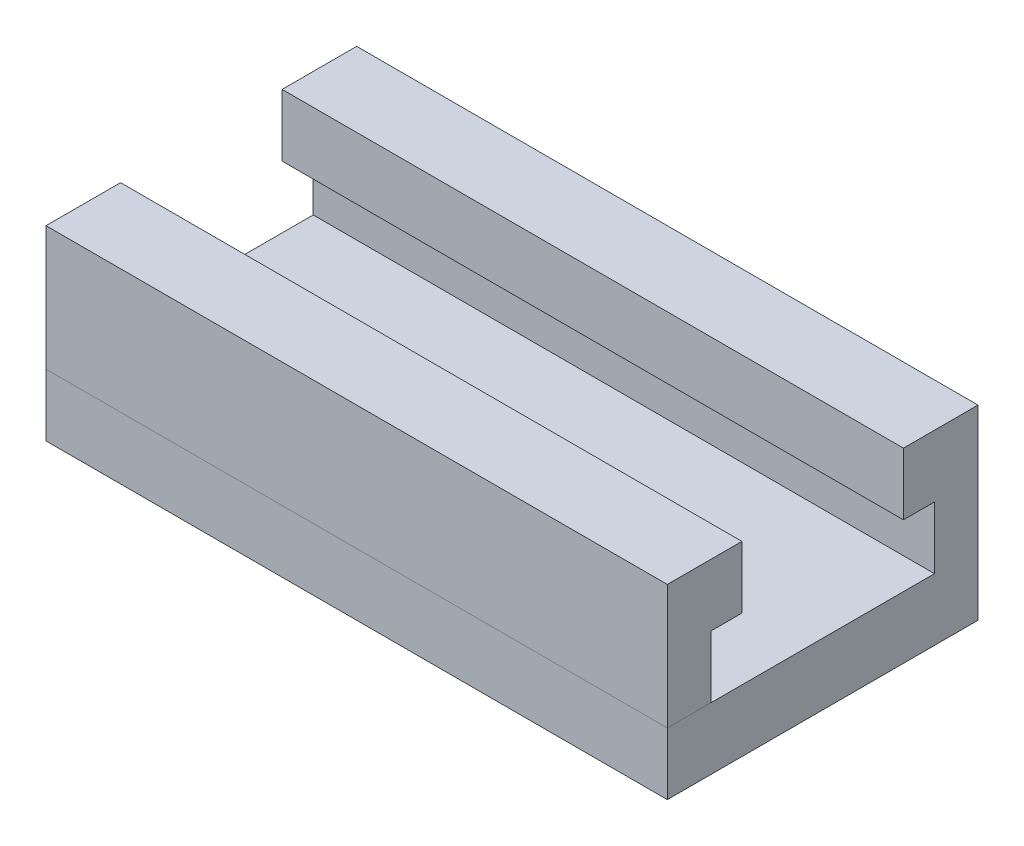
ISO-10303-21;
HEADER;
FILE_DESCRIPTION(('STEP AP214'),'2;1');
FILE_NAME('part.step','',(''),(''),'','','');
FILE_SCHEMA(('AUTOMOTIVE_DESIGN { 1 0 10303 214 1 1 1 1 }'));
ENDSEC;
DATA;
#1=APPLICATION_CONTEXT('core data for automotive mechanical design processes');
#2=APPLICATION_PROTOCOL_DEFINITION('international standard','automotive_design',2000,#1);
#3=PRODUCT_CONTEXT('',#1,'mechanical');
#4=PRODUCT('Part','Part','',(#3));
#5=PRODUCT_RELATED_PRODUCT_CATEGORY('part','',(#4));
#6=PRODUCT_DEFINITION_FORMATION('','',#4);
#7=PRODUCT_DEFINITION_CONTEXT('part definition',#1,'design');
#8=PRODUCT_DEFINITION('design','',#6,#7);
#9=PRODUCT_DEFINITION_SHAPE('','',#8);
#10=(LENGTH_UNIT() NAMED_UNIT(*) SI_UNIT(.MILLI.,.METRE.));
#11=(NAMED_UNIT(*) PLANE_ANGLE_UNIT() SI_UNIT($,.RADIAN.));
#12=(NAMED_UNIT(*) SI_UNIT($,.STERADIAN.) SOLID_ANGLE_UNIT());
#13=UNCERTAINTY_MEASURE_WITH_UNIT(LENGTH_MEASURE(1.E-05),#10,'distance_accuracy_value','');
#14=(GEOMETRIC_REPRESENTATION_CONTEXT(3) GLOBAL_UNCERTAINTY_ASSIGNED_CONTEXT((#13)) GLOBAL_UNIT_ASSIGNED_CONTEXT((#10,
#11,#12)) REPRESENTATION_CONTEXT('',''));
#15=CARTESIAN_POINT('',(0.,0.,0.));
#16=DIRECTION('',(0.,0.,1.));
#17=DIRECTION('',(1.,0.,0.));
#18=AXIS2_PLACEMENT_3D('',#15,#16,#17);
#19=CARTESIAN_POINT('',(0.,2.54,-4.572));
#20=DIRECTION('',(0.,0.,-1.));
#21=DIRECTION('',(-1.,0.,0.));
#22=AXIS2_PLACEMENT_3D('',#19,#20,#21);
#23=PLANE('',#22);
#24=DIRECTION('',(1.,0.,0.));
#25=VECTOR('',#24,1.);
#26=CARTESIAN_POINT('',(0.,0.,-4.572));
#27=LINE('',#26,#25);
#28=CARTESIAN_POINT('',(-9.525,0.,-4.572));
#29=VERTEX_POINT('',#28);
#30=CARTESIAN_POINT('',(15.875,0.,-4.572));
#31=VERTEX_POINT('',#30);
#32=EDGE_CURVE('E47',#29,#31,#27,.T.);
#33=ORIENTED_EDGE('',*,*,#32,.T.);
#34=DIRECTION('',(0.,-1.,0.));
#35=VECTOR('',#34,1.);
#36=CARTESIAN_POINT('',(15.875,2.54,-4.572));
#37=LINE('',#36,#35);
#38=CARTESIAN_POINT('',(15.875,2.54,-4.572));
#39=VERTEX_POINT('',#38);
#40=EDGE_CURVE('E12',#39,#31,#37,.T.);
#41=ORIENTED_EDGE('',*,*,#40,.F.);
#42=DIRECTION('',(1.,0.,0.));
#43=VECTOR('',#42,1.);
#44=CARTESIAN_POINT('',(0.,2.54,-4.572));
#45=LINE('',#44,#43);
#46=CARTESIAN_POINT('',(-9.525,2.54,-4.572));
#47=VERTEX_POINT('',#46);
#48=EDGE_CURVE('E154',#47,#39,#45,.T.);
#49=ORIENTED_EDGE('',*,*,#48,.F.);
#50=DIRECTION('',(0.,-1.,0.));
#51=VECTOR('',#50,1.);
#52=CARTESIAN_POINT('',(-9.525,2.54,-4.572));
#53=LINE('',#52,#51);
#54=EDGE_CURVE('E61',#47,#29,#53,.T.);
#55=ORIENTED_EDGE('',*,*,#54,.T.);
#56=EDGE_LOOP('',(#33,#41,#49,#55));
#57=FACE_BOUND('',#56,.T.);
#58=ADVANCED_FACE('F44',(#57),#23,.F.);
#59=CARTESIAN_POINT('',(15.875,2.54,0.));
#60=DIRECTION('',(1.,0.,0.));
#61=DIRECTION('',(0.,0.,-1.));
#62=AXIS2_PLACEMENT_3D('',#59,#60,#61);
#63=PLANE('',#62);
#64=ORIENTED_EDGE('',*,*,#40,.T.);
#65=DIRECTION('',(0.,0.,1.));
#66=VECTOR('',#65,1.);
#67=CARTESIAN_POINT('',(15.875,0.,-6.35));
#68=LINE('',#67,#66);
#69=CARTESIAN_POINT('',(15.875,0.,6.35));
#70=VERTEX_POINT('',#69);
#71=EDGE_CURVE('E130',#31,#70,#68,.T.);
#72=ORIENTED_EDGE('',*,*,#71,.T.);
#73=DIRECTION('',(0.,1.,0.));
#74=VECTOR('',#73,1.);
#75=CARTESIAN_POINT('',(15.875,-2.54,6.35));
#76=LINE('',#75,#74);
#77=CARTESIAN_POINT('',(15.875,-2.54,6.35));
#78=VERTEX_POINT('',#77);
#79=EDGE_CURVE('E112',#78,#70,#76,.T.);
#80=ORIENTED_EDGE('',*,*,#79,.F.);
#81=DIRECTION('',(0.,0.,1.));
#82=VECTOR('',#81,1.);
#83=CARTESIAN_POINT('',(15.875,-2.54,-6.35));
#84=LINE('',#83,#82);
#85=CARTESIAN_POINT('',(15.875,-2.54,-6.35));
#86=VERTEX_POINT('',#85);
#87=EDGE_CURVE('E119',#86,#78,#84,.T.);
#88=ORIENTED_EDGE('',*,*,#87,.F.);
#89=DIRECTION('',(0.,-1.,0.));
#90=VECTOR('',#89,1.);
#91=CARTESIAN_POINT('',(15.875,2.54,-6.35));
#92=LINE('',#91,#90);
#93=CARTESIAN_POINT('',(15.875,5.08,-6.35));
#94=VERTEX_POINT('',#93);
#95=EDGE_CURVE('E54',#94,#86,#92,.T.);
#96=ORIENTED_EDGE('',*,*,#95,.F.);
#97=DIRECTION('',(0.,0.,1.));
#98=VECTOR('',#97,1.);
#99=CARTESIAN_POINT('',(15.875,5.08,0.));
#100=LINE('',#99,#98);
#101=CARTESIAN_POINT('',(15.875,5.08,-3.302));
#102=VERTEX_POINT('',#101);
#103=EDGE_CURVE('E177',#94,#102,#100,.T.);
#104=ORIENTED_EDGE('',*,*,#103,.T.);
#105=DIRECTION('',(0.,-1.,0.));
#106=VECTOR('',#105,1.);
#107=CARTESIAN_POINT('',(15.875,5.08,-3.302));
#108=LINE('',#107,#106);
#109=CARTESIAN_POINT('',(15.875,2.54,-3.302));
#110=VERTEX_POINT('',#109);
#111=EDGE_CURVE('E191',#102,#110,#108,.T.);
#112=ORIENTED_EDGE('',*,*,#111,.T.);
#113=DIRECTION('',(0.,0.,1.));
#114=VECTOR('',#113,1.);
#115=CARTESIAN_POINT('',(15.875,2.54,0.));
#116=LINE('',#115,#114);
#117=EDGE_CURVE('E132',#39,#110,#116,.T.);
#118=ORIENTED_EDGE('',*,*,#117,.F.);
#119=EDGE_LOOP('',(#64,#72,#80,#88,#96,#104,#112,#118));
#120=FACE_BOUND('',#119,.T.);
#121=ADVANCED_FACE('F129',(#120),#63,.T.);
#122=CARTESIAN_POINT('',(0.,2.54,-6.35));
#123=DIRECTION('',(0.,0.,-1.));
#124=DIRECTION('',(-1.,0.,0.));
#125=AXIS2_PLACEMENT_3D('',#122,#123,#124);
#126=PLANE('',#125);
#127=ORIENTED_EDGE('',*,*,#95,.T.);
#128=DIRECTION('',(1.,0.,0.));
#129=VECTOR('',#128,1.);
#130=CARTESIAN_POINT('',(-9.525,-2.54,-6.35));
#131=LINE('',#130,#129);
#132=CARTESIAN_POINT('',(-9.525,-2.54,-6.35));
#133=VERTEX_POINT('',#132);
#134=EDGE_CURVE('E125',#133,#86,#131,.T.);
#135=ORIENTED_EDGE('',*,*,#134,.F.);
#136=DIRECTION('',(0.,-1.,0.));
#137=VECTOR('',#136,1.);
#138=CARTESIAN_POINT('',(-9.525,2.54,-6.35));
#139=LINE('',#138,#137);
#140=CARTESIAN_POINT('',(-9.525,5.08,-6.35));
#141=VERTEX_POINT('',#140);
#142=EDGE_CURVE('E156',#141,#133,#139,.T.);
#143=ORIENTED_EDGE('',*,*,#142,.F.);
#144=DIRECTION('',(1.,0.,0.));
#145=VECTOR('',#144,1.);
#146=CARTESIAN_POINT('',(0.,5.08,-6.35));
#147=LINE('',#146,#145);
#148=EDGE_CURVE('E173',#141,#94,#147,.T.);
#149=ORIENTED_EDGE('',*,*,#148,.T.);
#150=EDGE_LOOP('',(#127,#135,#143,#149));
#151=FACE_BOUND('',#150,.T.);
#152=ADVANCED_FACE('F171',(#151),#126,.T.);
#153=CARTESIAN_POINT('',(-9.525,2.54,0.));
#154=DIRECTION('',(-1.,0.,0.));
#155=DIRECTION('',(0.,0.,1.));
#156=AXIS2_PLACEMENT_3D('',#153,#154,#155);
#157=PLANE('',#156);
#158=ORIENTED_EDGE('',*,*,#142,.T.);
#159=DIRECTION('',(0.,0.,-1.));
#160=VECTOR('',#159,1.);
#161=CARTESIAN_POINT('',(-9.525,-2.54,-6.35));
#162=LINE('',#161,#160);
#163=CARTESIAN_POINT('',(-9.525,-2.54,6.35));
#164=VERTEX_POINT('',#163);
#165=EDGE_CURVE('E118',#164,#133,#162,.T.);
#166=ORIENTED_EDGE('',*,*,#165,.F.);
#167=DIRECTION('',(0.,1.,0.));
#168=VECTOR('',#167,1.);
#169=CARTESIAN_POINT('',(-9.525,-2.54,6.35));
#170=LINE('',#169,#168);
#171=CARTESIAN_POINT('',(-9.525,0.,6.35));
#172=VERTEX_POINT('',#171);
#173=EDGE_CURVE('E114',#164,#172,#170,.T.);
#174=ORIENTED_EDGE('',*,*,#173,.T.);
#175=DIRECTION('',(0.,0.,-1.));
#176=VECTOR('',#175,1.);
#177=CARTESIAN_POINT('',(-9.525,0.,-6.35));
#178=LINE('',#177,#176);
#179=EDGE_CURVE('E127',#172,#29,#178,.T.);
#180=ORIENTED_EDGE('',*,*,#179,.T.);
#181=ORIENTED_EDGE('',*,*,#54,.F.);
#182=DIRECTION('',(0.,0.,1.));
#183=VECTOR('',#182,1.);
#184=CARTESIAN_POINT('',(-9.525,2.54,0.));
#185=LINE('',#184,#183);
#186=CARTESIAN_POINT('',(-9.525,2.54,-3.302));
#187=VERTEX_POINT('',#186);
#188=EDGE_CURVE('E134',#47,#187,#185,.T.);
#189=ORIENTED_EDGE('',*,*,#188,.T.);
#190=DIRECTION('',(0.,-1.,0.));
#191=VECTOR('',#190,1.);
#192=CARTESIAN_POINT('',(-9.525,5.08,-3.302));
#193=LINE('',#192,#191);
#194=CARTESIAN_POINT('',(-9.525,5.08,-3.302));
#195=VERTEX_POINT('',#194);
#196=EDGE_CURVE('E195',#195,#187,#193,.T.);
#197=ORIENTED_EDGE('',*,*,#196,.F.);
#198=DIRECTION('',(0.,0.,1.));
#199=VECTOR('',#198,1.);
#200=CARTESIAN_POINT('',(-9.525,5.08,0.));
#201=LINE('',#200,#199);
#202=EDGE_CURVE('E184',#141,#195,#201,.T.);
#203=ORIENTED_EDGE('',*,*,#202,.F.);
#204=EDGE_LOOP('',(#158,#166,#174,#180,#181,#189,#197,#203));
#205=FACE_BOUND('',#204,.T.);
#206=ADVANCED_FACE('F149',(#205),#157,.T.);
#207=CARTESIAN_POINT('',(0.,2.54,0.));
#208=DIRECTION('',(0.,1.,0.));
#209=DIRECTION('',(0.,0.,1.));
#210=AXIS2_PLACEMENT_3D('',#207,#208,#209);
#211=PLANE('',#210);
#212=ORIENTED_EDGE('',*,*,#188,.F.);
#213=ORIENTED_EDGE('',*,*,#48,.T.);
#214=ORIENTED_EDGE('',*,*,#117,.T.);
#215=DIRECTION('',(1.,0.,0.));
#216=VECTOR('',#215,1.);
#217=CARTESIAN_POINT('',(0.,2.54,-3.302));
#218=LINE('',#217,#216);
#219=EDGE_CURVE('E183',#187,#110,#218,.T.);
#220=ORIENTED_EDGE('',*,*,#219,.F.);
#221=EDGE_LOOP('',(#212,#213,#214,#220));
#222=FACE_BOUND('',#221,.T.);
#223=ADVANCED_FACE('F204',(#222),#211,.F.);
#224=CARTESIAN_POINT('',(0.,5.08,-3.302));
#225=DIRECTION('',(0.,0.,-1.));
#226=DIRECTION('',(-1.,0.,0.));
#227=AXIS2_PLACEMENT_3D('',#224,#225,#226);
#228=PLANE('',#227);
#229=ORIENTED_EDGE('',*,*,#219,.T.);
#230=ORIENTED_EDGE('',*,*,#111,.F.);
#231=DIRECTION('',(1.,0.,0.));
#232=VECTOR('',#231,1.);
#233=CARTESIAN_POINT('',(0.,5.08,-3.302));
#234=LINE('',#233,#232);
#235=EDGE_CURVE('E181',#195,#102,#234,.T.);
#236=ORIENTED_EDGE('',*,*,#235,.F.);
#237=ORIENTED_EDGE('',*,*,#196,.T.);
#238=EDGE_LOOP('',(#229,#230,#236,#237));
#239=FACE_BOUND('',#238,.T.);
#240=ADVANCED_FACE('F201',(#239),#228,.F.);
#241=CARTESIAN_POINT('',(0.,5.08,0.));
#242=DIRECTION('',(0.,1.,0.));
#243=DIRECTION('',(0.,0.,1.));
#244=AXIS2_PLACEMENT_3D('',#241,#242,#243);
#245=PLANE('',#244);
#246=ORIENTED_EDGE('',*,*,#103,.F.);
#247=ORIENTED_EDGE('',*,*,#148,.F.);
#248=ORIENTED_EDGE('',*,*,#202,.T.);
#249=ORIENTED_EDGE('',*,*,#235,.T.);
#250=EDGE_LOOP('',(#246,#247,#248,#249));
#251=FACE_BOUND('',#250,.T.);
#252=ADVANCED_FACE('F179',(#251),#245,.T.);
#253=CARTESIAN_POINT('',(0.,0.,0.));
#254=DIRECTION('',(0.,1.,0.));
#255=DIRECTION('',(0.,0.,1.));
#256=AXIS2_PLACEMENT_3D('',#253,#254,#255);
#257=PLANE('',#256);
#258=ORIENTED_EDGE('',*,*,#32,.F.);
#259=ORIENTED_EDGE('',*,*,#179,.F.);
#260=DIRECTION('',(-1.,0.,0.));
#261=VECTOR('',#260,1.);
#262=CARTESIAN_POINT('',(-9.525,0.,6.35));
#263=LINE('',#262,#261);
#264=EDGE_CURVE('E141',#70,#172,#263,.T.);
#265=ORIENTED_EDGE('',*,*,#264,.F.);
#266=ORIENTED_EDGE('',*,*,#71,.F.);
#267=EDGE_LOOP('',(#258,#259,#265,#266));
#268=FACE_BOUND('',#267,.T.);
#269=ADVANCED_FACE('F236',(#268),#257,.T.);
#270=CARTESIAN_POINT('',(-9.525,-2.54,6.35));
#271=DIRECTION('',(0.,0.,-1.));
#272=DIRECTION('',(-1.,0.,0.));
#273=AXIS2_PLACEMENT_3D('',#270,#271,#272);
#274=PLANE('',#273);
#275=ORIENTED_EDGE('',*,*,#264,.T.);
#276=ORIENTED_EDGE('',*,*,#173,.F.);
#277=DIRECTION('',(-1.,0.,0.));
#278=VECTOR('',#277,1.);
#279=CARTESIAN_POINT('',(-9.525,-2.54,6.35));
#280=LINE('',#279,#278);
#281=EDGE_CURVE('E108',#78,#164,#280,.T.);
#282=ORIENTED_EDGE('',*,*,#281,.F.);
#283=ORIENTED_EDGE('',*,*,#79,.T.);
#284=EDGE_LOOP('',(#275,#276,#282,#283));
#285=FACE_BOUND('',#284,.T.);
#286=ADVANCED_FACE('F110',(#285),#274,.F.);
#287=CARTESIAN_POINT('',(0.,-2.54,0.));
#288=DIRECTION('',(0.,1.,0.));
#289=DIRECTION('',(0.,0.,1.));
#290=AXIS2_PLACEMENT_3D('',#287,#288,#289);
#291=PLANE('',#290);
#292=ORIENTED_EDGE('',*,*,#87,.T.);
#293=ORIENTED_EDGE('',*,*,#281,.T.);
#294=ORIENTED_EDGE('',*,*,#165,.T.);
#295=ORIENTED_EDGE('',*,*,#134,.T.);
#296=EDGE_LOOP('',(#292,#293,#294,#295));
#297=FACE_BOUND('',#296,.T.);
#298=ADVANCED_FACE('F123',(#297),#291,.F.);
#299=CLOSED_SHELL('',(#58,#121,#152,#206,#223,#240,#252,#269,#286,#298));
#300=MANIFOLD_SOLID_BREP('B2',#299);
#301=CARTESIAN_POINT('',(0.,2.54,4.572));
#302=DIRECTION('',(0.,0.,-1.));
#303=DIRECTION('',(-1.,0.,0.));
#304=AXIS2_PLACEMENT_3D('',#301,#302,#303);
#305=PLANE('',#304);
#306=DIRECTION('',(1.,0.,0.));
#307=VECTOR('',#306,1.);
#308=CARTESIAN_POINT('',(0.,0.,4.572));
#309=LINE('',#308,#307);
#310=CARTESIAN_POINT('',(-9.525,0.,4.572));
#311=VERTEX_POINT('',#310);
#312=CARTESIAN_POINT('',(15.875,0.,4.572));
#313=VERTEX_POINT('',#312);
#314=EDGE_CURVE('E379',#311,#313,#309,.T.);
#315=ORIENTED_EDGE('',*,*,#314,.F.);
#316=DIRECTION('',(0.,-1.,0.));
#317=VECTOR('',#316,1.);
#318=CARTESIAN_POINT('',(-9.525,2.54,4.572));
#319=LINE('',#318,#317);
#320=CARTESIAN_POINT('',(-9.525,2.54,4.572));
#321=VERTEX_POINT('',#320);
#322=EDGE_CURVE('E42',#321,#311,#319,.T.);
#323=ORIENTED_EDGE('',*,*,#322,.F.);
#324=DIRECTION('',(1.,0.,0.));
#325=VECTOR('',#324,1.);
#326=CARTESIAN_POINT('',(0.,2.54,4.572));
#327=LINE('',#326,#325);
#328=CARTESIAN_POINT('',(15.875,2.54,4.572));
#329=VERTEX_POINT('',#328);
#330=EDGE_CURVE('E380',#321,#329,#327,.T.);
#331=ORIENTED_EDGE('',*,*,#330,.T.);
#332=DIRECTION('',(0.,-1.,0.));
#333=VECTOR('',#332,1.);
#334=CARTESIAN_POINT('',(15.875,2.54,4.572));
#335=LINE('',#334,#333);
#336=EDGE_CURVE('E365',#329,#313,#335,.T.);
#337=ORIENTED_EDGE('',*,*,#336,.T.);
#338=EDGE_LOOP('',(#315,#323,#331,#337));
#339=FACE_BOUND('',#338,.T.);
#340=ADVANCED_FACE('F320',(#339),#305,.T.);
#341=CARTESIAN_POINT('',(-9.525,2.54,0.));
#342=DIRECTION('',(-1.,0.,0.));
#343=DIRECTION('',(0.,0.,1.));
#344=AXIS2_PLACEMENT_3D('',#341,#342,#343);
#345=PLANE('',#344);
#346=DIRECTION('',(0.,0.,-1.));
#347=VECTOR('',#346,1.);
#348=CARTESIAN_POINT('',(-9.525,0.,0.));
#349=LINE('',#348,#347);
#350=CARTESIAN_POINT('',(-9.525,0.,6.35));
#351=VERTEX_POINT('',#350);
#352=EDGE_CURVE('E374',#351,#311,#349,.T.);
#353=ORIENTED_EDGE('',*,*,#352,.F.);
#354=DIRECTION('',(0.,-1.,0.));
#355=VECTOR('',#354,1.);
#356=CARTESIAN_POINT('',(-9.525,2.54,6.35));
#357=LINE('',#356,#355);
#358=CARTESIAN_POINT('',(-9.525,5.08,6.35));
#359=VERTEX_POINT('',#358);
#360=EDGE_CURVE('E329',#359,#351,#357,.T.);
#361=ORIENTED_EDGE('',*,*,#360,.F.);
#362=DIRECTION('',(0.,0.,1.));
#363=VECTOR('',#362,1.);
#364=CARTESIAN_POINT('',(-9.525,5.08,0.));
#365=LINE('',#364,#363);
#366=CARTESIAN_POINT('',(-9.525,5.08,3.302));
#367=VERTEX_POINT('',#366);
#368=EDGE_CURVE('E415',#367,#359,#365,.T.);
#369=ORIENTED_EDGE('',*,*,#368,.F.);
#370=DIRECTION('',(0.,-1.,0.));
#371=VECTOR('',#370,1.);
#372=CARTESIAN_POINT('',(-9.525,5.08,3.302));
#373=LINE('',#372,#371);
#374=CARTESIAN_POINT('',(-9.525,2.54,3.302));
#375=VERTEX_POINT('',#374);
#376=EDGE_CURVE('E396',#367,#375,#373,.T.);
#377=ORIENTED_EDGE('',*,*,#376,.T.);
#378=DIRECTION('',(0.,0.,1.));
#379=VECTOR('',#378,1.);
#380=CARTESIAN_POINT('',(-9.525,2.54,0.));
#381=LINE('',#380,#379);
#382=EDGE_CURVE('E393',#375,#321,#381,.T.);
#383=ORIENTED_EDGE('',*,*,#382,.T.);
#384=ORIENTED_EDGE('',*,*,#322,.T.);
#385=EDGE_LOOP('',(#353,#361,#369,#377,#383,#384));
#386=FACE_BOUND('',#385,.T.);
#387=ADVANCED_FACE('F398',(#386),#345,.T.);
#388=CARTESIAN_POINT('',(0.,2.54,6.35));
#389=DIRECTION('',(0.,0.,1.));
#390=DIRECTION('',(1.,0.,0.));
#391=AXIS2_PLACEMENT_3D('',#388,#389,#390);
#392=PLANE('',#391);
#393=DIRECTION('',(-1.,0.,0.));
#394=VECTOR('',#393,1.);
#395=CARTESIAN_POINT('',(0.,0.,6.35));
#396=LINE('',#395,#394);
#397=CARTESIAN_POINT('',(15.875,0.,6.35));
#398=VERTEX_POINT('',#397);
#399=EDGE_CURVE('E368',#398,#351,#396,.T.);
#400=ORIENTED_EDGE('',*,*,#399,.F.);
#401=DIRECTION('',(0.,-1.,0.));
#402=VECTOR('',#401,1.);
#403=CARTESIAN_POINT('',(15.875,2.54,6.35));
#404=LINE('',#403,#402);
#405=CARTESIAN_POINT('',(15.875,5.08,6.35));
#406=VERTEX_POINT('',#405);
#407=EDGE_CURVE('E353',#406,#398,#404,.T.);
#408=ORIENTED_EDGE('',*,*,#407,.F.);
#409=DIRECTION('',(1.,0.,0.));
#410=VECTOR('',#409,1.);
#411=CARTESIAN_POINT('',(0.,5.08,6.35));
#412=LINE('',#411,#410);
#413=EDGE_CURVE('E426',#359,#406,#412,.T.);
#414=ORIENTED_EDGE('',*,*,#413,.F.);
#415=ORIENTED_EDGE('',*,*,#360,.T.);
#416=EDGE_LOOP('',(#400,#408,#414,#415));
#417=FACE_BOUND('',#416,.T.);
#418=ADVANCED_FACE('F369',(#417),#392,.T.);
#419=CARTESIAN_POINT('',(15.875,2.54,0.));
#420=DIRECTION('',(1.,0.,0.));
#421=DIRECTION('',(0.,0.,-1.));
#422=AXIS2_PLACEMENT_3D('',#419,#420,#421);
#423=PLANE('',#422);
#424=DIRECTION('',(0.,0.,1.));
#425=VECTOR('',#424,1.);
#426=CARTESIAN_POINT('',(15.875,0.,0.));
#427=LINE('',#426,#425);
#428=EDGE_CURVE('E357',#313,#398,#427,.T.);
#429=ORIENTED_EDGE('',*,*,#428,.F.);
#430=ORIENTED_EDGE('',*,*,#336,.F.);
#431=DIRECTION('',(0.,0.,1.));
#432=VECTOR('',#431,1.);
#433=CARTESIAN_POINT('',(15.875,2.54,0.));
#434=LINE('',#433,#432);
#435=CARTESIAN_POINT('',(15.875,2.54,3.302));
#436=VERTEX_POINT('',#435);
#437=EDGE_CURVE('E336',#436,#329,#434,.T.);
#438=ORIENTED_EDGE('',*,*,#437,.F.);
#439=DIRECTION('',(0.,-1.,0.));
#440=VECTOR('',#439,1.);
#441=CARTESIAN_POINT('',(15.875,5.08,3.302));
#442=LINE('',#441,#440);
#443=CARTESIAN_POINT('',(15.875,5.08,3.302));
#444=VERTEX_POINT('',#443);
#445=EDGE_CURVE('E410',#444,#436,#442,.T.);
#446=ORIENTED_EDGE('',*,*,#445,.F.);
#447=DIRECTION('',(0.,0.,1.));
#448=VECTOR('',#447,1.);
#449=CARTESIAN_POINT('',(15.875,5.08,0.));
#450=LINE('',#449,#448);
#451=EDGE_CURVE('E361',#444,#406,#450,.T.);
#452=ORIENTED_EDGE('',*,*,#451,.T.);
#453=ORIENTED_EDGE('',*,*,#407,.T.);
#454=EDGE_LOOP('',(#429,#430,#438,#446,#452,#453));
#455=FACE_BOUND('',#454,.T.);
#456=ADVANCED_FACE('F355',(#455),#423,.T.);
#457=CARTESIAN_POINT('',(0.,0.,0.));
#458=DIRECTION('',(0.,1.,0.));
#459=DIRECTION('',(0.,0.,1.));
#460=AXIS2_PLACEMENT_3D('',#457,#458,#459);
#461=PLANE('',#460);
#462=ORIENTED_EDGE('',*,*,#314,.T.);
#463=ORIENTED_EDGE('',*,*,#428,.T.);
#464=ORIENTED_EDGE('',*,*,#399,.T.);
#465=ORIENTED_EDGE('',*,*,#352,.T.);
#466=EDGE_LOOP('',(#462,#463,#464,#465));
#467=FACE_BOUND('',#466,.T.);
#468=ADVANCED_FACE('F377',(#467),#461,.F.);
#469=CARTESIAN_POINT('',(0.,5.08,3.302));
#470=DIRECTION('',(0.,0.,-1.));
#471=DIRECTION('',(-1.,0.,0.));
#472=AXIS2_PLACEMENT_3D('',#469,#470,#471);
#473=PLANE('',#472);
#474=DIRECTION('',(1.,0.,0.));
#475=VECTOR('',#474,1.);
#476=CARTESIAN_POINT('',(0.,2.54,3.302));
#477=LINE('',#476,#475);
#478=EDGE_CURVE('E417',#375,#436,#477,.T.);
#479=ORIENTED_EDGE('',*,*,#478,.F.);
#480=ORIENTED_EDGE('',*,*,#376,.F.);
#481=DIRECTION('',(1.,0.,0.));
#482=VECTOR('',#481,1.);
#483=CARTESIAN_POINT('',(0.,5.08,3.302));
#484=LINE('',#483,#482);
#485=EDGE_CURVE('E414',#367,#444,#484,.T.);
#486=ORIENTED_EDGE('',*,*,#485,.T.);
#487=ORIENTED_EDGE('',*,*,#445,.T.);
#488=EDGE_LOOP('',(#479,#480,#486,#487));
#489=FACE_BOUND('',#488,.T.);
#490=ADVANCED_FACE('F432',(#489),#473,.T.);
#491=CARTESIAN_POINT('',(0.,5.08,0.));
#492=DIRECTION('',(0.,1.,0.));
#493=DIRECTION('',(0.,0.,1.));
#494=AXIS2_PLACEMENT_3D('',#491,#492,#493);
#495=PLANE('',#494);
#496=ORIENTED_EDGE('',*,*,#485,.F.);
#497=ORIENTED_EDGE('',*,*,#368,.T.);
#498=ORIENTED_EDGE('',*,*,#413,.T.);
#499=ORIENTED_EDGE('',*,*,#451,.F.);
#500=EDGE_LOOP('',(#496,#497,#498,#499));
#501=FACE_BOUND('',#500,.T.);
#502=ADVANCED_FACE('F440',(#501),#495,.T.);
#503=CARTESIAN_POINT('',(0.,2.54,0.));
#504=DIRECTION('',(0.,1.,0.));
#505=DIRECTION('',(0.,0.,1.));
#506=AXIS2_PLACEMENT_3D('',#503,#504,#505);
#507=PLANE('',#506);
#508=ORIENTED_EDGE('',*,*,#330,.F.);
#509=ORIENTED_EDGE('',*,*,#382,.F.);
#510=ORIENTED_EDGE('',*,*,#478,.T.);
#511=ORIENTED_EDGE('',*,*,#437,.T.);
#512=EDGE_LOOP('',(#508,#509,#510,#511));
#513=FACE_BOUND('',#512,.T.);
#514=ADVANCED_FACE('F430',(#513),#507,.F.);
#515=CLOSED_SHELL('',(#340,#387,#418,#456,#468,#490,#502,#514));
#516=MANIFOLD_SOLID_BREP('B6',#515);
#517=ADVANCED_BREP_SHAPE_REPRESENTATION('',(#18,#300,#516),#14);
#518=SHAPE_DEFINITION_REPRESENTATION(#9,#517);
ENDSEC;
END-ISO-10303-21;
